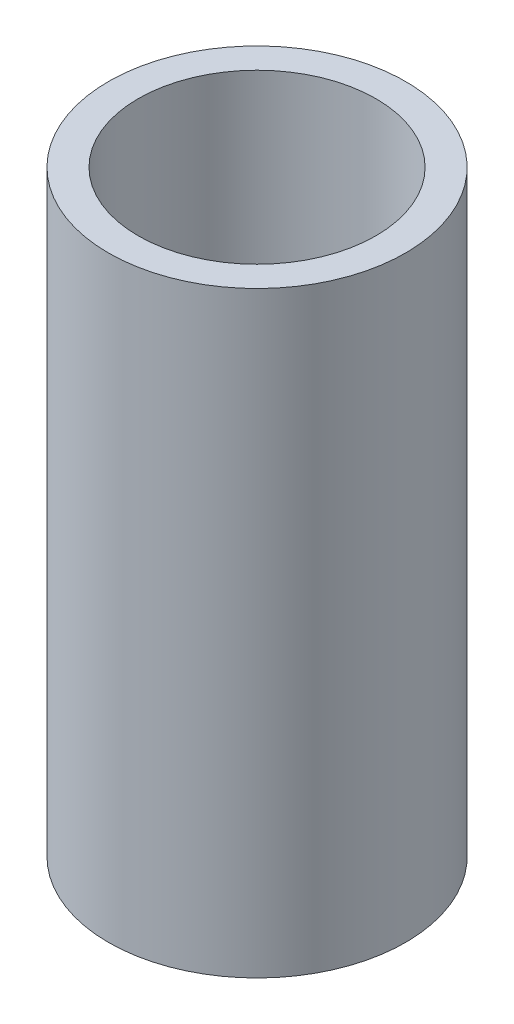
ISO-10303-21;
HEADER;
FILE_DESCRIPTION(('STEP AP214'),'2;1');
FILE_NAME('part.step','',(''),(''),'','','');
FILE_SCHEMA(('AUTOMOTIVE_DESIGN { 1 0 10303 214 1 1 1 1 }'));
ENDSEC;
DATA;
#1=APPLICATION_CONTEXT('core data for automotive mechanical design processes');
#2=APPLICATION_PROTOCOL_DEFINITION('international standard','automotive_design',2000,#1);
#3=PRODUCT_CONTEXT('',#1,'mechanical');
#4=PRODUCT('Part','Part','',(#3));
#5=PRODUCT_RELATED_PRODUCT_CATEGORY('part','',(#4));
#6=PRODUCT_DEFINITION_FORMATION('','',#4);
#7=PRODUCT_DEFINITION_CONTEXT('part definition',#1,'design');
#8=PRODUCT_DEFINITION('design','',#6,#7);
#9=PRODUCT_DEFINITION_SHAPE('','',#8);
#10=(LENGTH_UNIT() NAMED_UNIT(*) SI_UNIT(.MILLI.,.METRE.));
#11=(NAMED_UNIT(*) PLANE_ANGLE_UNIT() SI_UNIT($,.RADIAN.));
#12=(NAMED_UNIT(*) SI_UNIT($,.STERADIAN.) SOLID_ANGLE_UNIT());
#13=UNCERTAINTY_MEASURE_WITH_UNIT(LENGTH_MEASURE(1.E-05),#10,'distance_accuracy_value','');
#14=(GEOMETRIC_REPRESENTATION_CONTEXT(3) GLOBAL_UNCERTAINTY_ASSIGNED_CONTEXT((#13)) GLOBAL_UNIT_ASSIGNED_CONTEXT((#10,
#11,#12)) REPRESENTATION_CONTEXT('',''));
#15=CARTESIAN_POINT('',(0.,0.,0.));
#16=DIRECTION('',(0.,0.,1.));
#17=DIRECTION('',(1.,0.,0.));
#18=AXIS2_PLACEMENT_3D('',#15,#16,#17);
#19=CARTESIAN_POINT('',(0.,7.9756,0.));
#20=DIRECTION('',(0.,1.,0.));
#21=DIRECTION('',(0.,0.,1.));
#22=AXIS2_PLACEMENT_3D('',#19,#20,#21);
#23=PLANE('',#22);
#24=CARTESIAN_POINT('',(0.,7.9756,0.));
#25=DIRECTION('',(0.,1.,0.));
#26=DIRECTION('',(0.,0.,1.));
#27=AXIS2_PLACEMENT_3D('',#24,#25,#26);
#28=CIRCLE('',#27,1.984375);
#29=CARTESIAN_POINT('',(0.,7.9756,1.984375));
#30=VERTEX_POINT('',#29);
#31=EDGE_CURVE('E10',#30,#30,#28,.T.);
#32=ORIENTED_EDGE('',*,*,#31,.T.);
#33=EDGE_LOOP('',(#32));
#34=FACE_BOUND('',#33,.T.);
#35=CARTESIAN_POINT('',(0.,7.9756,0.));
#36=DIRECTION('',(0.,1.,0.));
#37=DIRECTION('',(0.,0.,1.));
#38=AXIS2_PLACEMENT_3D('',#35,#36,#37);
#39=CIRCLE('',#38,1.5875);
#40=CARTESIAN_POINT('',(0.,7.9756,1.5875));
#41=VERTEX_POINT('',#40);
#42=EDGE_CURVE('E369',#41,#41,#39,.T.);
#43=ORIENTED_EDGE('',*,*,#42,.F.);
#44=EDGE_LOOP('',(#43));
#45=FACE_BOUND('',#44,.T.);
#46=ADVANCED_FACE('F358',(#34,#45),#23,.T.);
#47=CARTESIAN_POINT('',(0.,0.,0.));
#48=DIRECTION('',(0.,1.,0.));
#49=DIRECTION('',(0.,0.,1.));
#50=AXIS2_PLACEMENT_3D('',#47,#48,#49);
#51=PLANE('',#50);
#52=CARTESIAN_POINT('',(0.,0.,0.));
#53=DIRECTION('',(0.,1.,0.));
#54=DIRECTION('',(0.,0.,1.));
#55=AXIS2_PLACEMENT_3D('',#52,#53,#54);
#56=CIRCLE('',#55,1.984375);
#57=CARTESIAN_POINT('',(0.,0.,1.984375));
#58=VERTEX_POINT('',#57);
#59=EDGE_CURVE('E365',#58,#58,#56,.T.);
#60=ORIENTED_EDGE('',*,*,#59,.F.);
#61=EDGE_LOOP('',(#60));
#62=FACE_BOUND('',#61,.T.);
#63=CARTESIAN_POINT('',(0.,0.,0.));
#64=DIRECTION('',(0.,1.,0.));
#65=DIRECTION('',(0.,0.,1.));
#66=AXIS2_PLACEMENT_3D('',#63,#64,#65);
#67=CIRCLE('',#66,1.5875);
#68=CARTESIAN_POINT('',(0.,0.,1.5875));
#69=VERTEX_POINT('',#68);
#70=EDGE_CURVE('E373',#69,#69,#67,.T.);
#71=ORIENTED_EDGE('',*,*,#70,.T.);
#72=EDGE_LOOP('',(#71));
#73=FACE_BOUND('',#72,.T.);
#74=ADVANCED_FACE('F379',(#62,#73),#51,.F.);
#75=CARTESIAN_POINT('',(0.,7.9756,0.));
#76=DIRECTION('',(0.,-1.,0.));
#77=DIRECTION('',(0.,0.,-1.));
#78=AXIS2_PLACEMENT_3D('',#75,#76,#77);
#79=CYLINDRICAL_SURFACE('',#78,1.984375);
#80=ORIENTED_EDGE('',*,*,#31,.F.);
#81=EDGE_LOOP('',(#80));
#82=FACE_BOUND('',#81,.T.);
#83=ORIENTED_EDGE('',*,*,#59,.T.);
#84=EDGE_LOOP('',(#83));
#85=FACE_BOUND('',#84,.T.);
#86=ADVANCED_FACE('F360',(#82,#85),#79,.T.);
#87=CARTESIAN_POINT('',(0.,7.9756,0.));
#88=DIRECTION('',(0.,-1.,0.));
#89=DIRECTION('',(0.,0.,-1.));
#90=AXIS2_PLACEMENT_3D('',#87,#88,#89);
#91=CYLINDRICAL_SURFACE('',#90,1.5875);
#92=ORIENTED_EDGE('',*,*,#42,.T.);
#93=EDGE_LOOP('',(#92));
#94=FACE_BOUND('',#93,.T.);
#95=ORIENTED_EDGE('',*,*,#70,.F.);
#96=EDGE_LOOP('',(#95));
#97=FACE_BOUND('',#96,.T.);
#98=ADVANCED_FACE('F381',(#94,#97),#91,.F.);
#99=CLOSED_SHELL('',(#46,#74,#86,#98));
#100=MANIFOLD_SOLID_BREP('B2',#99);
#101=ADVANCED_BREP_SHAPE_REPRESENTATION('',(#18,#100),#14);
#102=SHAPE_DEFINITION_REPRESENTATION(#9,#101);
ENDSEC;
END-ISO-10303-21;
